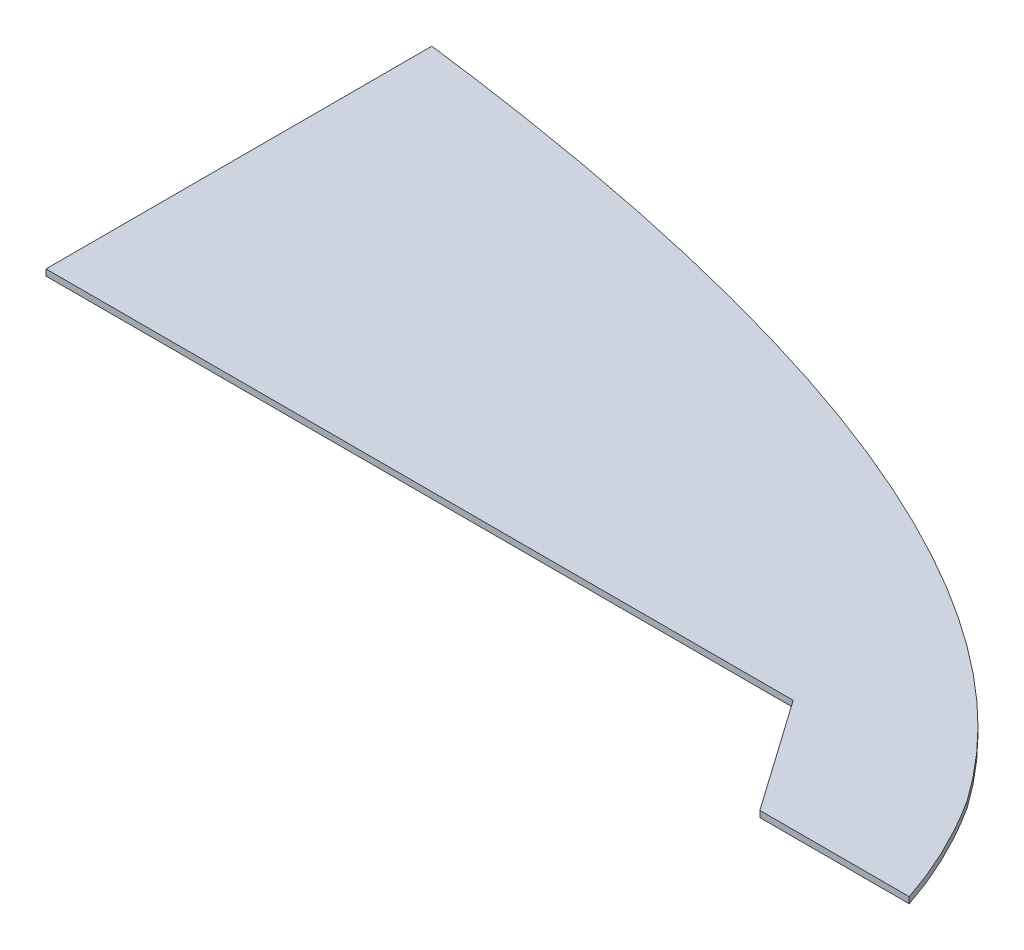
ISO-10303-21;
HEADER;
FILE_DESCRIPTION(('STEP AP214'),'2;1');
FILE_NAME('part.step','',(''),(''),'','','');
FILE_SCHEMA(('AUTOMOTIVE_DESIGN { 1 0 10303 214 1 1 1 1 }'));
ENDSEC;
DATA;
#1=APPLICATION_CONTEXT('core data for automotive mechanical design processes');
#2=APPLICATION_PROTOCOL_DEFINITION('international standard','automotive_design',2000,#1);
#3=PRODUCT_CONTEXT('',#1,'mechanical');
#4=PRODUCT('Part','Part','',(#3));
#5=PRODUCT_RELATED_PRODUCT_CATEGORY('part','',(#4));
#6=PRODUCT_DEFINITION_FORMATION('','',#4);
#7=PRODUCT_DEFINITION_CONTEXT('part definition',#1,'design');
#8=PRODUCT_DEFINITION('design','',#6,#7);
#9=PRODUCT_DEFINITION_SHAPE('','',#8);
#10=(LENGTH_UNIT() NAMED_UNIT(*) SI_UNIT(.MILLI.,.METRE.));
#11=(NAMED_UNIT(*) PLANE_ANGLE_UNIT() SI_UNIT($,.RADIAN.));
#12=(NAMED_UNIT(*) SI_UNIT($,.STERADIAN.) SOLID_ANGLE_UNIT());
#13=UNCERTAINTY_MEASURE_WITH_UNIT(LENGTH_MEASURE(1.E-05),#10,'distance_accuracy_value','');
#14=(GEOMETRIC_REPRESENTATION_CONTEXT(3) GLOBAL_UNCERTAINTY_ASSIGNED_CONTEXT((#13)) GLOBAL_UNIT_ASSIGNED_CONTEXT((#10,
#11,#12)) REPRESENTATION_CONTEXT('',''));
#15=CARTESIAN_POINT('',(0.,0.,0.));
#16=DIRECTION('',(0.,0.,1.));
#17=DIRECTION('',(1.,0.,0.));
#18=AXIS2_PLACEMENT_3D('',#15,#16,#17);
#19=CARTESIAN_POINT('',(2204.86407384603,1396.06710603682,1451.45455636937));
#20=CARTESIAN_POINT('',(2185.44490046643,1396.06710603682,1392.85557369052));
#21=CARTESIAN_POINT('',(2149.64325338427,1396.06710603682,1337.15455636953));
#22=B_SPLINE_CURVE_WITH_KNOTS('',2,(#19,#20,#21),.UNSPECIFIED.,.F.,.F.,(3,3),(0.,1.),.UNSPECIFIED.);
#23=DIRECTION('',(0.,1.,0.));
#24=VECTOR('',#23,1.);
#25=SURFACE_OF_LINEAR_EXTRUSION('',#22,#24);
#26=CARTESIAN_POINT('',(2204.86407384603,1402.41710603682,1451.45455636937));
#27=CARTESIAN_POINT('',(2185.44490046643,1402.41710603682,1392.85557369052));
#28=CARTESIAN_POINT('',(2149.64325338427,1402.41710603682,1337.15455636953));
#29=B_SPLINE_CURVE_WITH_KNOTS('',2,(#26,#27,#28),.UNSPECIFIED.,.F.,.F.,(3,3),(0.,1.),.UNSPECIFIED.);
#30=CARTESIAN_POINT('',(2204.86407384603,1402.41710603682,1451.45455636937));
#31=VERTEX_POINT('',#30);
#32=CARTESIAN_POINT('',(2149.64325338427,1402.41710603682,1337.15455636953));
#33=VERTEX_POINT('',#32);
#34=EDGE_CURVE('E120',#31,#33,#29,.T.);
#35=ORIENTED_EDGE('',*,*,#34,.F.);
#36=DIRECTION('',(0.,1.,0.));
#37=VECTOR('',#36,1.);
#38=CARTESIAN_POINT('',(2204.86407384603,1396.06710603682,1451.45455636937));
#39=LINE('',#38,#37);
#40=CARTESIAN_POINT('',(2204.86407384603,1396.06710603682,1451.45455636937));
#41=VERTEX_POINT('',#40);
#42=EDGE_CURVE('E11',#41,#31,#39,.T.);
#43=ORIENTED_EDGE('',*,*,#42,.F.);
#44=CARTESIAN_POINT('',(2149.64325338427,1396.06710603682,1337.15455636953));
#45=VERTEX_POINT('',#44);
#46=EDGE_CURVE('E165',#41,#45,#22,.T.);
#47=ORIENTED_EDGE('',*,*,#46,.T.);
#48=DIRECTION('',(0.,1.,0.));
#49=VECTOR('',#48,1.);
#50=CARTESIAN_POINT('',(2149.64325338427,1396.06710603682,1337.15455636953));
#51=LINE('',#50,#49);
#52=EDGE_CURVE('E52',#45,#33,#51,.T.);
#53=ORIENTED_EDGE('',*,*,#52,.T.);
#54=EDGE_LOOP('',(#35,#43,#47,#53));
#55=FACE_BOUND('',#54,.T.);
#56=ADVANCED_FACE('F35',(#55),#25,.T.);
#57=CARTESIAN_POINT('',(0.,1396.06710603682,1451.45455636937));
#58=DIRECTION('',(0.,0.,-1.));
#59=DIRECTION('',(0.,1.,0.));
#60=AXIS2_PLACEMENT_3D('',#57,#58,#59);
#61=PLANE('',#60);
#62=DIRECTION('',(-1.,0.,0.));
#63=VECTOR('',#62,1.);
#64=CARTESIAN_POINT('',(0.,1402.41710603682,1451.45455636937));
#65=LINE('',#64,#63);
#66=CARTESIAN_POINT('',(2052.46407384603,1402.41710603682,1451.45455636937));
#67=VERTEX_POINT('',#66);
#68=EDGE_CURVE('E149',#31,#67,#65,.T.);
#69=ORIENTED_EDGE('',*,*,#68,.T.);
#70=DIRECTION('',(0.,1.,0.));
#71=VECTOR('',#70,1.);
#72=CARTESIAN_POINT('',(2052.46407384603,1396.06710603682,1451.45455636937));
#73=LINE('',#72,#71);
#74=CARTESIAN_POINT('',(2052.46407384603,1396.06710603682,1451.45455636937));
#75=VERTEX_POINT('',#74);
#76=EDGE_CURVE('E44',#75,#67,#73,.T.);
#77=ORIENTED_EDGE('',*,*,#76,.F.);
#78=DIRECTION('',(-1.,0.,0.));
#79=VECTOR('',#78,1.);
#80=CARTESIAN_POINT('',(0.,1396.06710603682,1451.45455636937));
#81=LINE('',#80,#79);
#82=EDGE_CURVE('E171',#41,#75,#81,.T.);
#83=ORIENTED_EDGE('',*,*,#82,.F.);
#84=ORIENTED_EDGE('',*,*,#42,.T.);
#85=EDGE_LOOP('',(#69,#77,#83,#84));
#86=FACE_BOUND('',#85,.T.);
#87=ADVANCED_FACE('F140',(#86),#61,.F.);
#88=CARTESIAN_POINT('',(691.168167360453,1396.06710603682,-485.703478904748));
#89=DIRECTION('',(0.818181818180843,0.,-0.574959574577457));
#90=DIRECTION('',(-0.574959574577457,0.,-0.818181818180843));
#91=AXIS2_PLACEMENT_3D('',#88,#89,#90);
#92=PLANE('',#91);
#93=DIRECTION('',(-0.574959574577457,0.,-0.818181818180843));
#94=VECTOR('',#93,1.);
#95=CARTESIAN_POINT('',(691.168167360453,1402.41710603682,-485.703478904748));
#96=LINE('',#95,#94);
#97=CARTESIAN_POINT('',(1972.14222127757,1402.41710603682,1337.15455636952));
#98=VERTEX_POINT('',#97);
#99=EDGE_CURVE('E153',#67,#98,#96,.T.);
#100=ORIENTED_EDGE('',*,*,#99,.T.);
#101=DIRECTION('',(0.,1.,0.));
#102=VECTOR('',#101,1.);
#103=CARTESIAN_POINT('',(1972.14222127757,1396.06710603682,1337.15455636952));
#104=LINE('',#103,#102);
#105=CARTESIAN_POINT('',(1972.14222127757,1396.06710603682,1337.15455636952));
#106=VERTEX_POINT('',#105);
#107=EDGE_CURVE('E99',#106,#98,#104,.T.);
#108=ORIENTED_EDGE('',*,*,#107,.F.);
#109=DIRECTION('',(-0.574959574577457,0.,-0.818181818180843));
#110=VECTOR('',#109,1.);
#111=CARTESIAN_POINT('',(691.168167360453,1396.06710603682,-485.703478904748));
#112=LINE('',#111,#110);
#113=EDGE_CURVE('E108',#75,#106,#112,.T.);
#114=ORIENTED_EDGE('',*,*,#113,.F.);
#115=ORIENTED_EDGE('',*,*,#76,.T.);
#116=EDGE_LOOP('',(#100,#108,#114,#115));
#117=FACE_BOUND('',#116,.T.);
#118=ADVANCED_FACE('F138',(#117),#92,.F.);
#119=CARTESIAN_POINT('',(-3.22213582816028E-11,1396.06710603682,1337.15455636947));
#120=DIRECTION('',(0.,0.,1.));
#121=DIRECTION('',(1.,0.,0.));
#122=AXIS2_PLACEMENT_3D('',#119,#120,#121);
#123=PLANE('',#122);
#124=DIRECTION('',(1.,0.,0.));
#125=VECTOR('',#124,1.);
#126=CARTESIAN_POINT('',(-3.22213582816028E-11,1402.41710603682,1337.15455636947));
#127=LINE('',#126,#125);
#128=CARTESIAN_POINT('',(1209.75080176923,1402.41710603682,1337.15455636952));
#129=VERTEX_POINT('',#128);
#130=EDGE_CURVE('E95',#129,#98,#127,.T.);
#131=ORIENTED_EDGE('',*,*,#130,.F.);
#132=DIRECTION('',(0.,1.,0.));
#133=VECTOR('',#132,1.);
#134=CARTESIAN_POINT('',(1209.75080176923,1396.06710603682,1337.15455636952));
#135=LINE('',#134,#133);
#136=CARTESIAN_POINT('',(1209.75080176923,1396.06710603682,1337.15455636952));
#137=VERTEX_POINT('',#136);
#138=EDGE_CURVE('E90',#137,#129,#135,.T.);
#139=ORIENTED_EDGE('',*,*,#138,.F.);
#140=DIRECTION('',(1.,0.,0.));
#141=VECTOR('',#140,1.);
#142=CARTESIAN_POINT('',(-3.22213582816028E-11,1396.06710603682,1337.15455636947));
#143=LINE('',#142,#141);
#144=EDGE_CURVE('E93',#137,#106,#143,.T.);
#145=ORIENTED_EDGE('',*,*,#144,.T.);
#146=ORIENTED_EDGE('',*,*,#107,.T.);
#147=EDGE_LOOP('',(#131,#139,#145,#146));
#148=FACE_BOUND('',#147,.T.);
#149=ADVANCED_FACE('F92',(#148),#123,.T.);
#150=CARTESIAN_POINT('',(1209.75080176923,1396.06710603682,4.02927958254884E-13));
#151=DIRECTION('',(-1.,0.,0.));
#152=DIRECTION('',(0.,0.,1.));
#153=AXIS2_PLACEMENT_3D('',#150,#151,#152);
#154=PLANE('',#153);
#155=DIRECTION('',(0.,0.,1.));
#156=VECTOR('',#155,1.);
#157=CARTESIAN_POINT('',(1209.75080176923,1402.41710603682,4.02927958254884E-13));
#158=LINE('',#157,#156);
#159=CARTESIAN_POINT('',(1209.75080176923,1402.41710603682,943.454556369519));
#160=VERTEX_POINT('',#159);
#161=EDGE_CURVE('E156',#160,#129,#158,.T.);
#162=ORIENTED_EDGE('',*,*,#161,.F.);
#163=DIRECTION('',(0.,1.,0.));
#164=VECTOR('',#163,1.);
#165=CARTESIAN_POINT('',(1209.75080176923,1396.06710603682,943.454556369519));
#166=LINE('',#165,#164);
#167=CARTESIAN_POINT('',(1209.75080176923,1396.06710603682,943.454556369519));
#168=VERTEX_POINT('',#167);
#169=EDGE_CURVE('E71',#168,#160,#166,.T.);
#170=ORIENTED_EDGE('',*,*,#169,.F.);
#171=DIRECTION('',(0.,0.,1.));
#172=VECTOR('',#171,1.);
#173=CARTESIAN_POINT('',(1209.75080176923,1396.06710603682,4.02927958254884E-13));
#174=LINE('',#173,#172);
#175=EDGE_CURVE('E106',#168,#137,#174,.T.);
#176=ORIENTED_EDGE('',*,*,#175,.T.);
#177=ORIENTED_EDGE('',*,*,#138,.T.);
#178=EDGE_LOOP('',(#162,#170,#176,#177));
#179=FACE_BOUND('',#178,.T.);
#180=ADVANCED_FACE('F111',(#179),#154,.T.);
#181=CARTESIAN_POINT('',(2149.64325338427,1396.06710603682,1337.15455636953));
#182=CARTESIAN_POINT('',(1986.06424446918,1396.06710603682,1104.22942245428));
#183=CARTESIAN_POINT('',(1610.56131706185,1396.06710603682,993.645508143251));
#184=CARTESIAN_POINT('',(1209.75080176923,1396.06710603682,943.454556369519));
#185=B_SPLINE_CURVE_WITH_KNOTS('',3,(#181,#182,#183,#184),.UNSPECIFIED.,.F.,.F.,(4,4),(0.,1.),.UNSPECIFIED.);
#186=DIRECTION('',(0.,1.,0.));
#187=VECTOR('',#186,1.);
#188=SURFACE_OF_LINEAR_EXTRUSION('',#185,#187);
#189=CARTESIAN_POINT('',(2149.64325338427,1402.41710603682,1337.15455636953));
#190=CARTESIAN_POINT('',(1986.06424446918,1402.41710603682,1104.22942245428));
#191=CARTESIAN_POINT('',(1610.56131706185,1402.41710603682,993.645508143251));
#192=CARTESIAN_POINT('',(1209.75080176923,1402.41710603682,943.454556369519));
#193=B_SPLINE_CURVE_WITH_KNOTS('',3,(#189,#190,#191,#192),.UNSPECIFIED.,.F.,.F.,(4,4),(0.,1.),.UNSPECIFIED.);
#194=EDGE_CURVE('E160',#33,#160,#193,.T.);
#195=ORIENTED_EDGE('',*,*,#194,.F.);
#196=ORIENTED_EDGE('',*,*,#52,.F.);
#197=EDGE_CURVE('E112',#45,#168,#185,.T.);
#198=ORIENTED_EDGE('',*,*,#197,.T.);
#199=ORIENTED_EDGE('',*,*,#169,.T.);
#200=EDGE_LOOP('',(#195,#196,#198,#199));
#201=FACE_BOUND('',#200,.T.);
#202=ADVANCED_FACE('F128',(#201),#188,.T.);
#203=CARTESIAN_POINT('',(0.,1396.06710603682,0.));
#204=DIRECTION('',(0.,-1.,0.));
#205=DIRECTION('',(0.,0.,-1.));
#206=AXIS2_PLACEMENT_3D('',#203,#204,#205);
#207=PLANE('',#206);
#208=ORIENTED_EDGE('',*,*,#46,.F.);
#209=ORIENTED_EDGE('',*,*,#82,.T.);
#210=ORIENTED_EDGE('',*,*,#113,.T.);
#211=ORIENTED_EDGE('',*,*,#144,.F.);
#212=ORIENTED_EDGE('',*,*,#175,.F.);
#213=ORIENTED_EDGE('',*,*,#197,.F.);
#214=EDGE_LOOP('',(#208,#209,#210,#211,#212,#213));
#215=FACE_BOUND('',#214,.T.);
#216=ADVANCED_FACE('F104',(#215),#207,.T.);
#217=CARTESIAN_POINT('',(0.,1402.41710603682,0.));
#218=DIRECTION('',(0.,-1.,0.));
#219=DIRECTION('',(0.,0.,-1.));
#220=AXIS2_PLACEMENT_3D('',#217,#218,#219);
#221=PLANE('',#220);
#222=ORIENTED_EDGE('',*,*,#34,.T.);
#223=ORIENTED_EDGE('',*,*,#194,.T.);
#224=ORIENTED_EDGE('',*,*,#161,.T.);
#225=ORIENTED_EDGE('',*,*,#130,.T.);
#226=ORIENTED_EDGE('',*,*,#99,.F.);
#227=ORIENTED_EDGE('',*,*,#68,.F.);
#228=EDGE_LOOP('',(#222,#223,#224,#225,#226,#227));
#229=FACE_BOUND('',#228,.T.);
#230=ADVANCED_FACE('F132',(#229),#221,.F.);
#231=CLOSED_SHELL('',(#56,#87,#118,#149,#180,#202,#216,#230));
#232=MANIFOLD_SOLID_BREP('B2',#231);
#233=ADVANCED_BREP_SHAPE_REPRESENTATION('',(#18,#232),#14);
#234=SHAPE_DEFINITION_REPRESENTATION(#9,#233);
ENDSEC;
END-ISO-10303-21;
